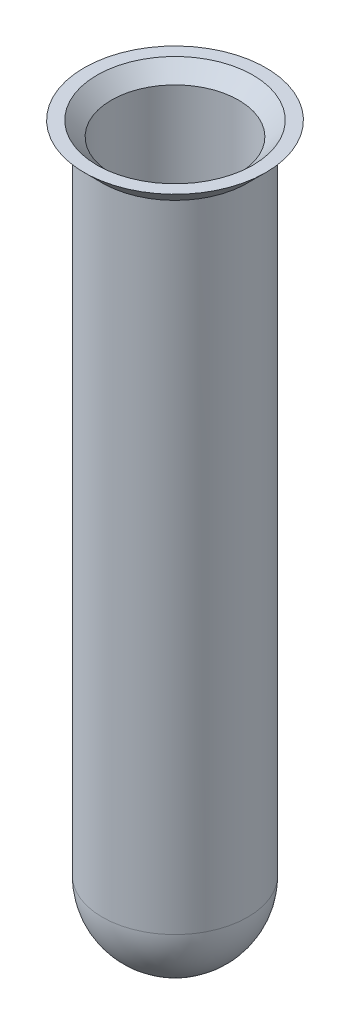
ISO-10303-21;
HEADER;
FILE_DESCRIPTION(('STEP AP214'),'2;1');
FILE_NAME('part.step','',(''),(''),'','','');
FILE_SCHEMA(('AUTOMOTIVE_DESIGN { 1 0 10303 214 1 1 1 1 }'));
ENDSEC;
DATA;
#1=APPLICATION_CONTEXT('core data for automotive mechanical design processes');
#2=APPLICATION_PROTOCOL_DEFINITION('international standard','automotive_design',2000,#1);
#3=PRODUCT_CONTEXT('',#1,'mechanical');
#4=PRODUCT('Part','Part','',(#3));
#5=PRODUCT_RELATED_PRODUCT_CATEGORY('part','',(#4));
#6=PRODUCT_DEFINITION_FORMATION('','',#4);
#7=PRODUCT_DEFINITION_CONTEXT('part definition',#1,'design');
#8=PRODUCT_DEFINITION('design','',#6,#7);
#9=PRODUCT_DEFINITION_SHAPE('','',#8);
#10=(LENGTH_UNIT() NAMED_UNIT(*) SI_UNIT(.MILLI.,.METRE.));
#11=(NAMED_UNIT(*) PLANE_ANGLE_UNIT() SI_UNIT($,.RADIAN.));
#12=(NAMED_UNIT(*) SI_UNIT($,.STERADIAN.) SOLID_ANGLE_UNIT());
#13=UNCERTAINTY_MEASURE_WITH_UNIT(LENGTH_MEASURE(1.E-05),#10,'distance_accuracy_value','');
#14=(GEOMETRIC_REPRESENTATION_CONTEXT(3) GLOBAL_UNCERTAINTY_ASSIGNED_CONTEXT((#13)) GLOBAL_UNIT_ASSIGNED_CONTEXT((#10,
#11,#12)) REPRESENTATION_CONTEXT('',''));
#15=CARTESIAN_POINT('',(0.,0.,0.));
#16=DIRECTION('',(0.,0.,1.));
#17=DIRECTION('',(1.,0.,0.));
#18=AXIS2_PLACEMENT_3D('',#15,#16,#17);
#19=CARTESIAN_POINT('',(0.,3.6777064926813,0.));
#20=DIRECTION('',(0.,-1.,0.));
#21=DIRECTION('',(1.,0.,0.));
#22=AXIS2_PLACEMENT_3D('',#19,#20,#21);
#23=PLANE('',#22);
#24=CARTESIAN_POINT('',(0.,3.6777064926813,0.));
#25=DIRECTION('',(0.,1.,0.));
#26=DIRECTION('',(-1.,0.,0.));
#27=AXIS2_PLACEMENT_3D('',#24,#25,#26);
#28=CIRCLE('',#27,10.);
#29=CARTESIAN_POINT('',(-10.,3.6777064926813,0.));
#30=VERTEX_POINT('',#29);
#31=EDGE_CURVE('E44',#30,#30,#28,.T.);
#32=ORIENTED_EDGE('',*,*,#31,.T.);
#33=EDGE_LOOP('',(#32));
#34=FACE_BOUND('',#33,.T.);
#35=CARTESIAN_POINT('',(0.,3.6777064926813,0.));
#36=DIRECTION('',(0.,-1.,0.));
#37=DIRECTION('',(1.,0.,0.));
#38=AXIS2_PLACEMENT_3D('',#35,#36,#37);
#39=CIRCLE('',#38,8.5857864376269);
#40=CARTESIAN_POINT('',(8.5857864376269,3.6777064926813,0.));
#41=VERTEX_POINT('',#40);
#42=EDGE_CURVE('E51',#41,#41,#39,.F.);
#43=ORIENTED_EDGE('',*,*,#42,.F.);
#44=EDGE_LOOP('',(#43));
#45=FACE_BOUND('',#44,.T.);
#46=ADVANCED_FACE('F33',(#34,#45),#23,.F.);
#47=CARTESIAN_POINT('',(0.,-68.3222935073187,0.));
#48=DIRECTION('',(0.,1.,0.));
#49=DIRECTION('',(1.,0.,0.));
#50=AXIS2_PLACEMENT_3D('',#47,#48,#49);
#51=SPHERICAL_SURFACE('',#50,8.);
#52=CARTESIAN_POINT('',(0.,-68.3222935073187,0.));
#53=DIRECTION('',(0.,1.,0.));
#54=DIRECTION('',(-1.,0.,0.));
#55=AXIS2_PLACEMENT_3D('',#52,#53,#54);
#56=CIRCLE('',#55,8.);
#57=CARTESIAN_POINT('',(-7.99999999999999,-68.3222935073187,0.));
#58=VERTEX_POINT('',#57);
#59=EDGE_CURVE('E10',#58,#58,#56,.T.);
#60=ORIENTED_EDGE('',*,*,#59,.F.);
#61=EDGE_LOOP('',(#60));
#62=FACE_BOUND('',#61,.T.);
#63=ADVANCED_FACE('F35',(#62),#51,.T.);
#64=CARTESIAN_POINT('',(0.,3.6777064926813,0.));
#65=DIRECTION('',(0.,1.,0.));
#66=DIRECTION('',(-1.,0.,0.));
#67=AXIS2_PLACEMENT_3D('',#64,#65,#66);
#68=CYLINDRICAL_SURFACE('',#67,8.);
#69=CARTESIAN_POINT('',(0.,1.6777064926813,0.));
#70=DIRECTION('',(0.,1.,0.));
#71=DIRECTION('',(-1.,0.,0.));
#72=AXIS2_PLACEMENT_3D('',#69,#70,#71);
#73=CIRCLE('',#72,8.);
#74=CARTESIAN_POINT('',(-8.,1.6777064926813,0.));
#75=VERTEX_POINT('',#74);
#76=EDGE_CURVE('E40',#75,#75,#73,.T.);
#77=ORIENTED_EDGE('',*,*,#76,.F.);
#78=EDGE_LOOP('',(#77));
#79=FACE_BOUND('',#78,.T.);
#80=ORIENTED_EDGE('',*,*,#59,.T.);
#81=EDGE_LOOP('',(#80));
#82=FACE_BOUND('',#81,.T.);
#83=ADVANCED_FACE('F81',(#79,#82),#68,.T.);
#84=CARTESIAN_POINT('',(0.,1.6777064926813,0.));
#85=DIRECTION('',(0.,1.,0.));
#86=DIRECTION('',(-1.,0.,0.));
#87=AXIS2_PLACEMENT_3D('',#84,#85,#86);
#88=CONICAL_SURFACE('',#87,8.,0.785398163397448);
#89=ORIENTED_EDGE('',*,*,#31,.F.);
#90=EDGE_LOOP('',(#89));
#91=FACE_BOUND('',#90,.T.);
#92=ORIENTED_EDGE('',*,*,#76,.T.);
#93=EDGE_LOOP('',(#92));
#94=FACE_BOUND('',#93,.T.);
#95=ADVANCED_FACE('F73',(#91,#94),#88,.T.);
#96=CARTESIAN_POINT('',(0.,-68.3222935073187,0.));
#97=DIRECTION('',(0.,1.,0.));
#98=DIRECTION('',(1.,0.,0.));
#99=AXIS2_PLACEMENT_3D('',#96,#97,#98);
#100=SPHERICAL_SURFACE('',#99,7.);
#101=CARTESIAN_POINT('',(0.,-68.3222935073187,0.));
#102=DIRECTION('',(0.,1.,0.));
#103=DIRECTION('',(-1.,0.,0.));
#104=AXIS2_PLACEMENT_3D('',#101,#102,#103);
#105=CIRCLE('',#104,7.);
#106=CARTESIAN_POINT('',(-6.99999999999999,-68.3222935073187,0.));
#107=VERTEX_POINT('',#106);
#108=EDGE_CURVE('E48',#107,#107,#105,.T.);
#109=ORIENTED_EDGE('',*,*,#108,.T.);
#110=EDGE_LOOP('',(#109));
#111=FACE_BOUND('',#110,.T.);
#112=ADVANCED_FACE('F60',(#111),#100,.F.);
#113=CARTESIAN_POINT('',(0.,3.6777064926813,0.));
#114=DIRECTION('',(0.,1.,0.));
#115=DIRECTION('',(-1.,0.,0.));
#116=AXIS2_PLACEMENT_3D('',#113,#114,#115);
#117=CYLINDRICAL_SURFACE('',#116,7.);
#118=CARTESIAN_POINT('',(0.,2.0919200550544,0.));
#119=DIRECTION('',(0.,1.,0.));
#120=DIRECTION('',(-1.,0.,0.));
#121=AXIS2_PLACEMENT_3D('',#118,#119,#120);
#122=CIRCLE('',#121,7.);
#123=CARTESIAN_POINT('',(-7.,2.09192005505439,0.));
#124=VERTEX_POINT('',#123);
#125=EDGE_CURVE('E54',#124,#124,#122,.T.);
#126=ORIENTED_EDGE('',*,*,#125,.T.);
#127=EDGE_LOOP('',(#126));
#128=FACE_BOUND('',#127,.T.);
#129=ORIENTED_EDGE('',*,*,#108,.F.);
#130=EDGE_LOOP('',(#129));
#131=FACE_BOUND('',#130,.T.);
#132=ADVANCED_FACE('F62',(#128,#131),#117,.F.);
#133=CARTESIAN_POINT('',(0.,2.38481327386785,0.));
#134=DIRECTION('',(0.,1.,0.));
#135=DIRECTION('',(-1.,0.,0.));
#136=AXIS2_PLACEMENT_3D('',#133,#134,#135);
#137=CONICAL_SURFACE('',#136,7.29289321881345,0.785398163397448);
#138=ORIENTED_EDGE('',*,*,#42,.T.);
#139=EDGE_LOOP('',(#138));
#140=FACE_BOUND('',#139,.T.);
#141=ORIENTED_EDGE('',*,*,#125,.F.);
#142=EDGE_LOOP('',(#141));
#143=FACE_BOUND('',#142,.T.);
#144=ADVANCED_FACE('F64',(#140,#143),#137,.F.);
#145=CLOSED_SHELL('',(#46,#63,#83,#95,#112,#132,#144));
#146=MANIFOLD_SOLID_BREP('B2',#145);
#147=ADVANCED_BREP_SHAPE_REPRESENTATION('',(#18,#146),#14);
#148=SHAPE_DEFINITION_REPRESENTATION(#9,#147);
ENDSEC;
END-ISO-10303-21;
